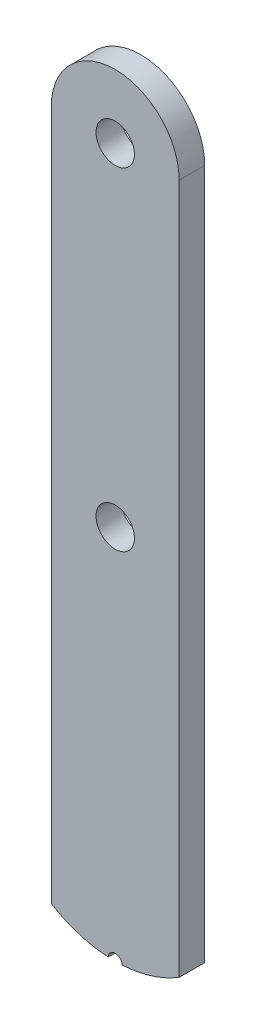
ISO-10303-21;
HEADER;
FILE_DESCRIPTION(('STEP AP214'),'2;1');
FILE_NAME('part.step','',(''),(''),'','','');
FILE_SCHEMA(('AUTOMOTIVE_DESIGN { 1 0 10303 214 1 1 1 1 }'));
ENDSEC;
DATA;
#1=APPLICATION_CONTEXT('core data for automotive mechanical design processes');
#2=APPLICATION_PROTOCOL_DEFINITION('international standard','automotive_design',2000,#1);
#3=PRODUCT_CONTEXT('',#1,'mechanical');
#4=PRODUCT('Part','Part','',(#3));
#5=PRODUCT_RELATED_PRODUCT_CATEGORY('part','',(#4));
#6=PRODUCT_DEFINITION_FORMATION('','',#4);
#7=PRODUCT_DEFINITION_CONTEXT('part definition',#1,'design');
#8=PRODUCT_DEFINITION('design','',#6,#7);
#9=PRODUCT_DEFINITION_SHAPE('','',#8);
#10=(LENGTH_UNIT() NAMED_UNIT(*) SI_UNIT(.MILLI.,.METRE.));
#11=(NAMED_UNIT(*) PLANE_ANGLE_UNIT() SI_UNIT($,.RADIAN.));
#12=(NAMED_UNIT(*) SI_UNIT($,.STERADIAN.) SOLID_ANGLE_UNIT());
#13=UNCERTAINTY_MEASURE_WITH_UNIT(LENGTH_MEASURE(1.E-05),#10,'distance_accuracy_value','');
#14=(GEOMETRIC_REPRESENTATION_CONTEXT(3) GLOBAL_UNCERTAINTY_ASSIGNED_CONTEXT((#13)) GLOBAL_UNIT_ASSIGNED_CONTEXT((#10,
#11,#12)) REPRESENTATION_CONTEXT('',''));
#15=CARTESIAN_POINT('',(0.,0.,0.));
#16=DIRECTION('',(0.,0.,1.));
#17=DIRECTION('',(1.,0.,0.));
#18=AXIS2_PLACEMENT_3D('',#15,#16,#17);
#19=CARTESIAN_POINT('',(0.,-21.364848451745,2.));
#20=DIRECTION('',(0.,0.,-1.));
#21=DIRECTION('',(-1.,0.,0.));
#22=AXIS2_PLACEMENT_3D('',#19,#20,#21);
#23=CYLINDRICAL_SURFACE('',#22,9.54885808424625);
#24=CARTESIAN_POINT('',(0.,-21.364848451745,0.));
#25=DIRECTION('',(0.,0.,1.));
#26=DIRECTION('',(-1.,0.,0.));
#27=AXIS2_PLACEMENT_3D('',#24,#25,#26);
#28=CIRCLE('',#27,9.54885808424625);
#29=CARTESIAN_POINT('',(-5.,-29.5,0.));
#30=VERTEX_POINT('',#29);
#31=CARTESIAN_POINT('',(-0.550172610978943,-30.8978438262957,0.));
#32=VERTEX_POINT('',#31);
#33=EDGE_CURVE('E119',#30,#32,#28,.T.);
#34=ORIENTED_EDGE('',*,*,#33,.T.);
#35=DIRECTION('',(0.,0.,1.));
#36=VECTOR('',#35,1.);
#37=CARTESIAN_POINT('',(-0.550172610978943,-30.8978438262957,-3.));
#38=LINE('',#37,#36);
#39=CARTESIAN_POINT('',(-0.550172610978943,-30.8978438262957,2.));
#40=VERTEX_POINT('',#39);
#41=EDGE_CURVE('E11',#32,#40,#38,.T.);
#42=ORIENTED_EDGE('',*,*,#41,.T.);
#43=CARTESIAN_POINT('',(0.,-21.364848451745,2.));
#44=DIRECTION('',(0.,0.,1.));
#45=DIRECTION('',(-1.,0.,0.));
#46=AXIS2_PLACEMENT_3D('',#43,#44,#45);
#47=CIRCLE('',#46,9.54885808424625);
#48=CARTESIAN_POINT('',(-5.,-29.5,2.));
#49=VERTEX_POINT('',#48);
#50=EDGE_CURVE('E102',#49,#40,#47,.T.);
#51=ORIENTED_EDGE('',*,*,#50,.F.);
#52=DIRECTION('',(0.,0.,-1.));
#53=VECTOR('',#52,1.);
#54=CARTESIAN_POINT('',(-5.,-29.5,2.));
#55=LINE('',#54,#53);
#56=EDGE_CURVE('E118',#49,#30,#55,.T.);
#57=ORIENTED_EDGE('',*,*,#56,.T.);
#58=EDGE_LOOP('',(#34,#42,#51,#57));
#59=FACE_BOUND('',#58,.T.);
#60=ADVANCED_FACE('F34',(#59),#23,.T.);
#61=CARTESIAN_POINT('',(0.,-21.364848451745,2.));
#62=DIRECTION('',(0.,0.,-1.));
#63=DIRECTION('',(-1.,0.,0.));
#64=AXIS2_PLACEMENT_3D('',#61,#62,#63);
#65=PLANE('',#64);
#66=CARTESIAN_POINT('',(0.,24.5,2.));
#67=DIRECTION('',(0.,0.,1.));
#68=DIRECTION('',(1.,0.,0.));
#69=AXIS2_PLACEMENT_3D('',#66,#67,#68);
#70=CIRCLE('',#69,1.5);
#71=CARTESIAN_POINT('',(1.5,24.5,2.));
#72=VERTEX_POINT('',#71);
#73=EDGE_CURVE('E154',#72,#72,#70,.T.);
#74=ORIENTED_EDGE('',*,*,#73,.F.);
#75=EDGE_LOOP('',(#74));
#76=FACE_BOUND('',#75,.T.);
#77=ORIENTED_EDGE('',*,*,#50,.T.);
#78=CARTESIAN_POINT('',(0.,-30.9137065359913,2.));
#79=DIRECTION('',(0.,0.,1.));
#80=DIRECTION('',(1.,0.,0.));
#81=AXIS2_PLACEMENT_3D('',#78,#79,#80);
#82=CIRCLE('',#81,0.550401242213602);
#83=CARTESIAN_POINT('',(0.550172610978944,-30.8978438262957,2.));
#84=VERTEX_POINT('',#83);
#85=EDGE_CURVE('E95',#84,#40,#82,.T.);
#86=ORIENTED_EDGE('',*,*,#85,.F.);
#87=CARTESIAN_POINT('',(5.,-29.5,2.));
#88=VERTEX_POINT('',#87);
#89=EDGE_CURVE('E86',#84,#88,#47,.T.);
#90=ORIENTED_EDGE('',*,*,#89,.T.);
#91=DIRECTION('',(0.,1.,0.));
#92=VECTOR('',#91,1.);
#93=CARTESIAN_POINT('',(5.,24.5,2.));
#94=LINE('',#93,#92);
#95=CARTESIAN_POINT('',(5.,24.5,2.));
#96=VERTEX_POINT('',#95);
#97=EDGE_CURVE('E107',#88,#96,#94,.T.);
#98=ORIENTED_EDGE('',*,*,#97,.T.);
#99=CARTESIAN_POINT('',(0.,24.5,2.));
#100=DIRECTION('',(0.,0.,1.));
#101=DIRECTION('',(1.,0.,0.));
#102=AXIS2_PLACEMENT_3D('',#99,#100,#101);
#103=CIRCLE('',#102,5.);
#104=CARTESIAN_POINT('',(-5.,24.5,2.));
#105=VERTEX_POINT('',#104);
#106=EDGE_CURVE('E115',#96,#105,#103,.T.);
#107=ORIENTED_EDGE('',*,*,#106,.T.);
#108=DIRECTION('',(0.,-1.,0.));
#109=VECTOR('',#108,1.);
#110=CARTESIAN_POINT('',(-5.,24.5,2.));
#111=LINE('',#110,#109);
#112=EDGE_CURVE('E58',#105,#49,#111,.T.);
#113=ORIENTED_EDGE('',*,*,#112,.T.);
#114=EDGE_LOOP('',(#77,#86,#90,#98,#107,#113));
#115=FACE_BOUND('',#114,.T.);
#116=CARTESIAN_POINT('',(0.,-1.49999999999999,2.));
#117=DIRECTION('',(0.,0.,1.));
#118=DIRECTION('',(1.,0.,0.));
#119=AXIS2_PLACEMENT_3D('',#116,#117,#118);
#120=CIRCLE('',#119,1.5);
#121=CARTESIAN_POINT('',(1.5,-1.49999999999999,2.));
#122=VERTEX_POINT('',#121);
#123=EDGE_CURVE('E150',#122,#122,#120,.T.);
#124=ORIENTED_EDGE('',*,*,#123,.F.);
#125=EDGE_LOOP('',(#124));
#126=FACE_BOUND('',#125,.T.);
#127=ADVANCED_FACE('F99',(#76,#115,#126),#65,.F.);
#128=CARTESIAN_POINT('',(0.,-21.364848451745,0.));
#129=DIRECTION('',(0.,0.,-1.));
#130=DIRECTION('',(-1.,0.,0.));
#131=AXIS2_PLACEMENT_3D('',#128,#129,#130);
#132=PLANE('',#131);
#133=CARTESIAN_POINT('',(0.,-30.9137065359913,0.));
#134=DIRECTION('',(0.,0.,-1.));
#135=DIRECTION('',(-1.,0.,0.));
#136=AXIS2_PLACEMENT_3D('',#133,#134,#135);
#137=CIRCLE('',#136,0.550401242213602);
#138=CARTESIAN_POINT('',(0.550172610978945,-30.8978438262957,0.));
#139=VERTEX_POINT('',#138);
#140=EDGE_CURVE('E49',#32,#139,#137,.T.);
#141=ORIENTED_EDGE('',*,*,#140,.F.);
#142=ORIENTED_EDGE('',*,*,#33,.F.);
#143=DIRECTION('',(0.,-1.,0.));
#144=VECTOR('',#143,1.);
#145=CARTESIAN_POINT('',(-5.,24.5,0.));
#146=LINE('',#145,#144);
#147=CARTESIAN_POINT('',(-5.,24.5,0.));
#148=VERTEX_POINT('',#147);
#149=EDGE_CURVE('E79',#148,#30,#146,.T.);
#150=ORIENTED_EDGE('',*,*,#149,.F.);
#151=CARTESIAN_POINT('',(0.,24.5,0.));
#152=DIRECTION('',(0.,0.,1.));
#153=DIRECTION('',(1.,0.,0.));
#154=AXIS2_PLACEMENT_3D('',#151,#152,#153);
#155=CIRCLE('',#154,5.);
#156=CARTESIAN_POINT('',(5.,24.5,0.));
#157=VERTEX_POINT('',#156);
#158=EDGE_CURVE('E108',#157,#148,#155,.T.);
#159=ORIENTED_EDGE('',*,*,#158,.F.);
#160=DIRECTION('',(0.,1.,0.));
#161=VECTOR('',#160,1.);
#162=CARTESIAN_POINT('',(5.,24.5,0.));
#163=LINE('',#162,#161);
#164=CARTESIAN_POINT('',(5.,-29.5,0.));
#165=VERTEX_POINT('',#164);
#166=EDGE_CURVE('E122',#165,#157,#163,.T.);
#167=ORIENTED_EDGE('',*,*,#166,.F.);
#168=EDGE_CURVE('E123',#139,#165,#28,.T.);
#169=ORIENTED_EDGE('',*,*,#168,.F.);
#170=EDGE_LOOP('',(#141,#142,#150,#159,#167,#169));
#171=FACE_BOUND('',#170,.T.);
#172=CARTESIAN_POINT('',(0.,24.5,0.));
#173=DIRECTION('',(0.,0.,1.));
#174=DIRECTION('',(1.,0.,0.));
#175=AXIS2_PLACEMENT_3D('',#172,#173,#174);
#176=CIRCLE('',#175,1.5);
#177=CARTESIAN_POINT('',(1.5,24.5,0.));
#178=VERTEX_POINT('',#177);
#179=EDGE_CURVE('E112',#178,#178,#176,.T.);
#180=ORIENTED_EDGE('',*,*,#179,.T.);
#181=EDGE_LOOP('',(#180));
#182=FACE_BOUND('',#181,.T.);
#183=CARTESIAN_POINT('',(0.,-1.49999999999999,0.));
#184=DIRECTION('',(0.,0.,1.));
#185=DIRECTION('',(1.,0.,0.));
#186=AXIS2_PLACEMENT_3D('',#183,#184,#185);
#187=CIRCLE('',#186,1.5);
#188=CARTESIAN_POINT('',(1.5,-1.49999999999999,0.));
#189=VERTEX_POINT('',#188);
#190=EDGE_CURVE('E147',#189,#189,#187,.T.);
#191=ORIENTED_EDGE('',*,*,#190,.T.);
#192=EDGE_LOOP('',(#191));
#193=FACE_BOUND('',#192,.T.);
#194=ADVANCED_FACE('F145',(#171,#182,#193),#132,.T.);
#195=ORIENTED_EDGE('',*,*,#89,.F.);
#196=DIRECTION('',(0.,0.,1.));
#197=VECTOR('',#196,1.);
#198=CARTESIAN_POINT('',(0.550172610978944,-30.8978438262957,-3.));
#199=LINE('',#198,#197);
#200=EDGE_CURVE('E42',#84,#139,#199,.F.);
#201=ORIENTED_EDGE('',*,*,#200,.T.);
#202=ORIENTED_EDGE('',*,*,#168,.T.);
#203=DIRECTION('',(0.,0.,-1.));
#204=VECTOR('',#203,1.);
#205=CARTESIAN_POINT('',(5.,-29.5,2.));
#206=LINE('',#205,#204);
#207=EDGE_CURVE('E98',#88,#165,#206,.T.);
#208=ORIENTED_EDGE('',*,*,#207,.F.);
#209=EDGE_LOOP('',(#195,#201,#202,#208));
#210=FACE_BOUND('',#209,.T.);
#211=ADVANCED_FACE('F36',(#210),#23,.T.);
#212=CARTESIAN_POINT('',(5.,24.5,2.));
#213=DIRECTION('',(-1.,0.,0.));
#214=DIRECTION('',(0.,-1.,0.));
#215=AXIS2_PLACEMENT_3D('',#212,#213,#214);
#216=PLANE('',#215);
#217=ORIENTED_EDGE('',*,*,#166,.T.);
#218=DIRECTION('',(0.,0.,-1.));
#219=VECTOR('',#218,1.);
#220=CARTESIAN_POINT('',(5.,24.5,2.));
#221=LINE('',#220,#219);
#222=EDGE_CURVE('E129',#96,#157,#221,.T.);
#223=ORIENTED_EDGE('',*,*,#222,.F.);
#224=ORIENTED_EDGE('',*,*,#97,.F.);
#225=ORIENTED_EDGE('',*,*,#207,.T.);
#226=EDGE_LOOP('',(#217,#223,#224,#225));
#227=FACE_BOUND('',#226,.T.);
#228=ADVANCED_FACE('F133',(#227),#216,.F.);
#229=CARTESIAN_POINT('',(0.,24.5,2.));
#230=DIRECTION('',(0.,0.,-1.));
#231=DIRECTION('',(-1.,0.,0.));
#232=AXIS2_PLACEMENT_3D('',#229,#230,#231);
#233=CYLINDRICAL_SURFACE('',#232,5.);
#234=ORIENTED_EDGE('',*,*,#158,.T.);
#235=DIRECTION('',(0.,0.,-1.));
#236=VECTOR('',#235,1.);
#237=CARTESIAN_POINT('',(-5.,24.5,2.));
#238=LINE('',#237,#236);
#239=EDGE_CURVE('E127',#105,#148,#238,.T.);
#240=ORIENTED_EDGE('',*,*,#239,.F.);
#241=ORIENTED_EDGE('',*,*,#106,.F.);
#242=ORIENTED_EDGE('',*,*,#222,.T.);
#243=EDGE_LOOP('',(#234,#240,#241,#242));
#244=FACE_BOUND('',#243,.T.);
#245=ADVANCED_FACE('F139',(#244),#233,.T.);
#246=CARTESIAN_POINT('',(-5.,24.5,2.));
#247=DIRECTION('',(1.,0.,0.));
#248=DIRECTION('',(0.,1.,0.));
#249=AXIS2_PLACEMENT_3D('',#246,#247,#248);
#250=PLANE('',#249);
#251=ORIENTED_EDGE('',*,*,#149,.T.);
#252=ORIENTED_EDGE('',*,*,#56,.F.);
#253=ORIENTED_EDGE('',*,*,#112,.F.);
#254=ORIENTED_EDGE('',*,*,#239,.T.);
#255=EDGE_LOOP('',(#251,#252,#253,#254));
#256=FACE_BOUND('',#255,.T.);
#257=ADVANCED_FACE('F141',(#256),#250,.F.);
#258=CARTESIAN_POINT('',(0.,24.5,2.));
#259=DIRECTION('',(0.,0.,-1.));
#260=DIRECTION('',(-1.,0.,0.));
#261=AXIS2_PLACEMENT_3D('',#258,#259,#260);
#262=CYLINDRICAL_SURFACE('',#261,1.5);
#263=ORIENTED_EDGE('',*,*,#73,.T.);
#264=EDGE_LOOP('',(#263));
#265=FACE_BOUND('',#264,.T.);
#266=ORIENTED_EDGE('',*,*,#179,.F.);
#267=EDGE_LOOP('',(#266));
#268=FACE_BOUND('',#267,.T.);
#269=ADVANCED_FACE('F162',(#265,#268),#262,.F.);
#270=CARTESIAN_POINT('',(0.,-1.49999999999999,2.));
#271=DIRECTION('',(0.,0.,-1.));
#272=DIRECTION('',(-1.,0.,0.));
#273=AXIS2_PLACEMENT_3D('',#270,#271,#272);
#274=CYLINDRICAL_SURFACE('',#273,1.5);
#275=ORIENTED_EDGE('',*,*,#123,.T.);
#276=EDGE_LOOP('',(#275));
#277=FACE_BOUND('',#276,.T.);
#278=ORIENTED_EDGE('',*,*,#190,.F.);
#279=EDGE_LOOP('',(#278));
#280=FACE_BOUND('',#279,.T.);
#281=ADVANCED_FACE('F164',(#277,#280),#274,.F.);
#282=CARTESIAN_POINT('',(0.,-30.9137065359913,-8.));
#283=DIRECTION('',(0.,0.,1.));
#284=DIRECTION('',(1.,0.,0.));
#285=AXIS2_PLACEMENT_3D('',#282,#283,#284);
#286=CYLINDRICAL_SURFACE('',#285,0.550401242213602);
#287=ORIENTED_EDGE('',*,*,#140,.T.);
#288=ORIENTED_EDGE('',*,*,#200,.F.);
#289=ORIENTED_EDGE('',*,*,#85,.T.);
#290=ORIENTED_EDGE('',*,*,#41,.F.);
#291=EDGE_LOOP('',(#287,#288,#289,#290));
#292=FACE_BOUND('',#291,.T.);
#293=ADVANCED_FACE('F94',(#292),#286,.F.);
#294=CLOSED_SHELL('',(#60,#127,#194,#211,#228,#245,#257,#269,#281,#293));
#295=MANIFOLD_SOLID_BREP('B2',#294);
#296=ADVANCED_BREP_SHAPE_REPRESENTATION('',(#18,#295),#14);
#297=SHAPE_DEFINITION_REPRESENTATION(#9,#296);
ENDSEC;
END-ISO-10303-21;
